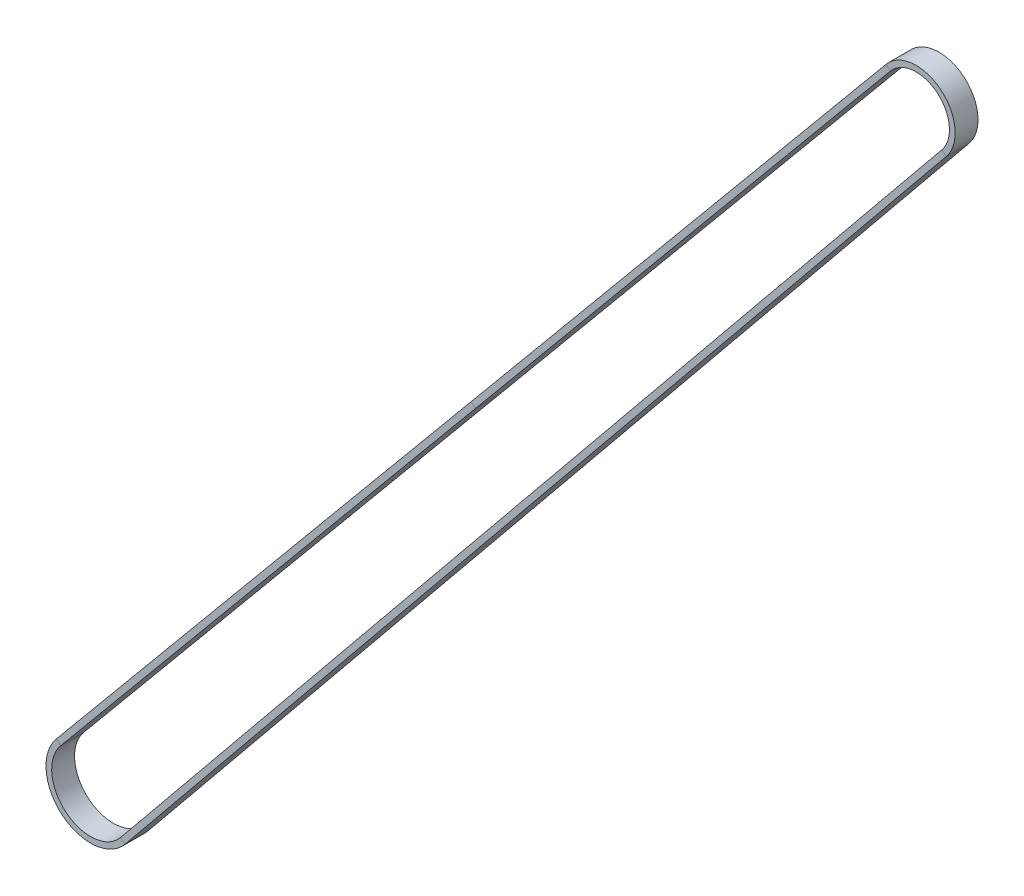
ISO-10303-21;
HEADER;
FILE_DESCRIPTION(('STEP AP214'),'2;1');
FILE_NAME('part.step','',(''),(''),'','','');
FILE_SCHEMA(('AUTOMOTIVE_DESIGN { 1 0 10303 214 1 1 1 1 }'));
ENDSEC;
DATA;
#1=APPLICATION_CONTEXT('core data for automotive mechanical design processes');
#2=APPLICATION_PROTOCOL_DEFINITION('international standard','automotive_design',2000,#1);
#3=PRODUCT_CONTEXT('',#1,'mechanical');
#4=PRODUCT('Part','Part','',(#3));
#5=PRODUCT_RELATED_PRODUCT_CATEGORY('part','',(#4));
#6=PRODUCT_DEFINITION_FORMATION('','',#4);
#7=PRODUCT_DEFINITION_CONTEXT('part definition',#1,'design');
#8=PRODUCT_DEFINITION('design','',#6,#7);
#9=PRODUCT_DEFINITION_SHAPE('','',#8);
#10=(LENGTH_UNIT() NAMED_UNIT(*) SI_UNIT(.MILLI.,.METRE.));
#11=(NAMED_UNIT(*) PLANE_ANGLE_UNIT() SI_UNIT($,.RADIAN.));
#12=(NAMED_UNIT(*) SI_UNIT($,.STERADIAN.) SOLID_ANGLE_UNIT());
#13=UNCERTAINTY_MEASURE_WITH_UNIT(LENGTH_MEASURE(1.E-05),#10,'distance_accuracy_value','');
#14=(GEOMETRIC_REPRESENTATION_CONTEXT(3) GLOBAL_UNCERTAINTY_ASSIGNED_CONTEXT((#13)) GLOBAL_UNIT_ASSIGNED_CONTEXT((#10,
#11,#12)) REPRESENTATION_CONTEXT('',''));
#15=CARTESIAN_POINT('',(0.,0.,0.));
#16=DIRECTION('',(0.,0.,1.));
#17=DIRECTION('',(1.,0.,0.));
#18=AXIS2_PLACEMENT_3D('',#15,#16,#17);
#19=CARTESIAN_POINT('',(-9.00101622856847,7.47473791199665,3.));
#20=DIRECTION('',(0.769317626373385,-0.638866488204867,0.));
#21=DIRECTION('',(0.638866488204868,0.769317626373386,0.));
#22=AXIS2_PLACEMENT_3D('',#19,#20,#21);
#23=PLANE('',#22);
#24=DIRECTION('',(0.,0.,-1.));
#25=VECTOR('',#24,1.);
#26=CARTESIAN_POINT('',(-9.00101622856948,7.4747379119974,3.));
#27=LINE('',#26,#25);
#28=CARTESIAN_POINT('',(-9.00101622856857,7.47473791199665,3.));
#29=VERTEX_POINT('',#28);
#30=CARTESIAN_POINT('',(-9.00101622856857,7.47473791199665,-3.));
#31=VERTEX_POINT('',#30);
#32=EDGE_CURVE('E167',#29,#31,#27,.T.);
#33=ORIENTED_EDGE('',*,*,#32,.F.);
#34=DIRECTION('',(0.638866488204867,0.769317626373385,0.));
#35=VECTOR('',#34,1.);
#36=CARTESIAN_POINT('',(-9.00101622856847,7.47473791199665,3.));
#37=LINE('',#36,#35);
#38=CARTESIAN_POINT('',(99.8938376959289,138.60500079504,3.));
#39=VERTEX_POINT('',#38);
#40=EDGE_CURVE('E166',#29,#39,#37,.T.);
#41=ORIENTED_EDGE('',*,*,#40,.T.);
#42=DIRECTION('',(0.,0.,-1.));
#43=VECTOR('',#42,1.);
#44=CARTESIAN_POINT('',(99.8938376959289,138.60500079504,3.));
#45=LINE('',#44,#43);
#46=CARTESIAN_POINT('',(99.8938376959289,138.60500079504,-3.));
#47=VERTEX_POINT('',#46);
#48=EDGE_CURVE('E141',#39,#47,#45,.T.);
#49=ORIENTED_EDGE('',*,*,#48,.T.);
#50=DIRECTION('',(0.638866488204867,0.769317626373385,0.));
#51=VECTOR('',#50,1.);
#52=CARTESIAN_POINT('',(-9.00101622856847,7.47473791199665,-3.));
#53=LINE('',#52,#51);
#54=EDGE_CURVE('E171',#31,#47,#53,.T.);
#55=ORIENTED_EDGE('',*,*,#54,.F.);
#56=EDGE_LOOP('',(#33,#41,#49,#55));
#57=FACE_BOUND('',#56,.T.);
#58=ADVANCED_FACE('F33',(#57),#23,.F.);
#59=CARTESIAN_POINT('',(99.8938376959289,138.60500079504,3.));
#60=DIRECTION('',(0.769317626373385,-0.638866488204867,0.));
#61=DIRECTION('',(0.638866488204868,0.769317626373386,0.));
#62=AXIS2_PLACEMENT_3D('',#59,#60,#61);
#63=PLANE('',#62);
#64=DIRECTION('',(0.638866488204867,0.769317626373385,0.));
#65=VECTOR('',#64,1.);
#66=CARTESIAN_POINT('',(99.8938376959289,138.60500079504,-3.));
#67=LINE('',#66,#65);
#68=CARTESIAN_POINT('',(208.788691620426,269.735263678083,-3.));
#69=VERTEX_POINT('',#68);
#70=EDGE_CURVE('E147',#47,#69,#67,.T.);
#71=ORIENTED_EDGE('',*,*,#70,.F.);
#72=ORIENTED_EDGE('',*,*,#48,.F.);
#73=DIRECTION('',(0.638866488204867,0.769317626373385,0.));
#74=VECTOR('',#73,1.);
#75=CARTESIAN_POINT('',(99.8938376959289,138.60500079504,3.));
#76=LINE('',#75,#74);
#77=CARTESIAN_POINT('',(208.788691620426,269.735263678083,3.));
#78=VERTEX_POINT('',#77);
#79=EDGE_CURVE('E145',#39,#78,#76,.T.);
#80=ORIENTED_EDGE('',*,*,#79,.T.);
#81=DIRECTION('',(0.,0.,-1.));
#82=VECTOR('',#81,1.);
#83=CARTESIAN_POINT('',(208.788691620426,269.735263678083,3.));
#84=LINE('',#83,#82);
#85=EDGE_CURVE('E163',#78,#69,#84,.T.);
#86=ORIENTED_EDGE('',*,*,#85,.T.);
#87=EDGE_LOOP('',(#71,#72,#80,#86));
#88=FACE_BOUND('',#87,.T.);
#89=ADVANCED_FACE('F143',(#88),#63,.F.);
#90=CARTESIAN_POINT('',(99.8938376959289,138.60500079504,-3.));
#91=DIRECTION('',(0.,0.,1.));
#92=DIRECTION('',(1.,0.,0.));
#93=AXIS2_PLACEMENT_3D('',#90,#91,#92);
#94=PLANE('',#93);
#95=DIRECTION('',(0.638866488204867,0.769317626373385,0.));
#96=VECTOR('',#95,1.);
#97=CARTESIAN_POINT('',(101.047814135489,137.646701062732,-3.));
#98=LINE('',#97,#96);
#99=CARTESIAN_POINT('',(101.047814135489,137.646701062732,-3.));
#100=VERTEX_POINT('',#99);
#101=CARTESIAN_POINT('',(209.942668059986,268.776963945775,-3.));
#102=VERTEX_POINT('',#101);
#103=EDGE_CURVE('E212',#100,#102,#98,.T.);
#104=ORIENTED_EDGE('',*,*,#103,.F.);
#105=DIRECTION('',(0.769317626373389,-0.638866488204863,0.));
#106=VECTOR('',#105,1.);
#107=CARTESIAN_POINT('',(99.8938376959289,138.60500079504,-3.));
#108=LINE('',#107,#106);
#109=EDGE_CURVE('E152',#47,#100,#108,.T.);
#110=ORIENTED_EDGE('',*,*,#109,.F.);
#111=ORIENTED_EDGE('',*,*,#70,.T.);
#112=DIRECTION('',(0.769317626373389,-0.638866488204863,0.));
#113=VECTOR('',#112,1.);
#114=CARTESIAN_POINT('',(208.788691620426,269.735263678083,-3.));
#115=LINE('',#114,#113);
#116=EDGE_CURVE('E237',#69,#102,#115,.T.);
#117=ORIENTED_EDGE('',*,*,#116,.T.);
#118=EDGE_LOOP('',(#104,#110,#111,#117));
#119=FACE_BOUND('',#118,.T.);
#120=ADVANCED_FACE('F257',(#119),#94,.F.);
#121=CARTESIAN_POINT('',(101.047814135489,137.646701062732,3.));
#122=DIRECTION('',(-0.769317626373385,0.638866488204867,0.));
#123=DIRECTION('',(-0.638866488204868,-0.769317626373386,0.));
#124=AXIS2_PLACEMENT_3D('',#121,#122,#123);
#125=PLANE('',#124);
#126=DIRECTION('',(0.638866488204867,0.769317626373385,0.));
#127=VECTOR('',#126,1.);
#128=CARTESIAN_POINT('',(101.047814135489,137.646701062732,3.));
#129=LINE('',#128,#127);
#130=CARTESIAN_POINT('',(101.047814135489,137.646701062732,3.));
#131=VERTEX_POINT('',#130);
#132=CARTESIAN_POINT('',(209.942668059986,268.776963945775,3.));
#133=VERTEX_POINT('',#132);
#134=EDGE_CURVE('E182',#131,#133,#129,.T.);
#135=ORIENTED_EDGE('',*,*,#134,.F.);
#136=DIRECTION('',(0.,0.,1.));
#137=VECTOR('',#136,1.);
#138=CARTESIAN_POINT('',(101.047814135489,137.646701062732,3.));
#139=LINE('',#138,#137);
#140=EDGE_CURVE('E174',#100,#131,#139,.T.);
#141=ORIENTED_EDGE('',*,*,#140,.F.);
#142=ORIENTED_EDGE('',*,*,#103,.T.);
#143=DIRECTION('',(0.,0.,1.));
#144=VECTOR('',#143,1.);
#145=CARTESIAN_POINT('',(209.942668059986,268.776963945775,3.));
#146=LINE('',#145,#144);
#147=EDGE_CURVE('E214',#102,#133,#146,.T.);
#148=ORIENTED_EDGE('',*,*,#147,.T.);
#149=EDGE_LOOP('',(#135,#141,#142,#148));
#150=FACE_BOUND('',#149,.T.);
#151=ADVANCED_FACE('F210',(#150),#125,.F.);
#152=CARTESIAN_POINT('',(99.8938376959289,138.60500079504,3.));
#153=DIRECTION('',(0.,0.,-1.));
#154=DIRECTION('',(-1.,0.,0.));
#155=AXIS2_PLACEMENT_3D('',#152,#153,#154);
#156=PLANE('',#155);
#157=DIRECTION('',(-0.769317626373389,0.638866488204863,0.));
#158=VECTOR('',#157,1.);
#159=CARTESIAN_POINT('',(208.788691620426,269.735263678083,3.));
#160=LINE('',#159,#158);
#161=EDGE_CURVE('E161',#133,#78,#160,.T.);
#162=ORIENTED_EDGE('',*,*,#161,.T.);
#163=ORIENTED_EDGE('',*,*,#79,.F.);
#164=DIRECTION('',(-0.769317626373389,0.638866488204863,0.));
#165=VECTOR('',#164,1.);
#166=CARTESIAN_POINT('',(99.8938376959289,138.60500079504,3.));
#167=LINE('',#166,#165);
#168=EDGE_CURVE('E159',#131,#39,#167,.T.);
#169=ORIENTED_EDGE('',*,*,#168,.F.);
#170=ORIENTED_EDGE('',*,*,#134,.T.);
#171=EDGE_LOOP('',(#162,#163,#169,#170));
#172=FACE_BOUND('',#171,.T.);
#173=ADVANCED_FACE('F157',(#172),#156,.F.);
#174=CARTESIAN_POINT('',(216.674197290753,263.186882173983,0.));
#175=DIRECTION('',(0.,0.,-1.));
#176=DIRECTION('',(-1.,0.,0.));
#177=AXIS2_PLACEMENT_3D('',#174,#175,#176);
#178=CYLINDRICAL_SURFACE('',#177,10.2499999999999);
#179=CARTESIAN_POINT('',(216.674197290753,263.186882173983,-3.));
#180=DIRECTION('',(0.,0.,-1.));
#181=DIRECTION('',(-0.769317626373392,0.63886648820486,0.));
#182=AXIS2_PLACEMENT_3D('',#179,#180,#181);
#183=CIRCLE('',#182,10.2499999999999);
#184=CARTESIAN_POINT('',(224.615122985578,256.705817515358,-3.));
#185=VERTEX_POINT('',#184);
#186=EDGE_CURVE('E126',#69,#185,#183,.T.);
#187=ORIENTED_EDGE('',*,*,#186,.F.);
#188=ORIENTED_EDGE('',*,*,#85,.F.);
#189=CARTESIAN_POINT('',(216.674197290753,263.186882173983,3.));
#190=DIRECTION('',(0.,0.,-1.));
#191=DIRECTION('',(-0.769317626373392,0.63886648820486,0.));
#192=AXIS2_PLACEMENT_3D('',#189,#190,#191);
#193=CIRCLE('',#192,10.2499999999999);
#194=CARTESIAN_POINT('',(224.615122985578,256.705817515358,3.));
#195=VERTEX_POINT('',#194);
#196=EDGE_CURVE('E181',#78,#195,#193,.T.);
#197=ORIENTED_EDGE('',*,*,#196,.T.);
#198=DIRECTION('',(0.,0.,-1.));
#199=VECTOR('',#198,1.);
#200=CARTESIAN_POINT('',(224.615122985578,256.705817515358,3.));
#201=LINE('',#200,#199);
#202=EDGE_CURVE('E242',#195,#185,#201,.T.);
#203=ORIENTED_EDGE('',*,*,#202,.T.);
#204=EDGE_LOOP('',(#187,#188,#197,#203));
#205=FACE_BOUND('',#204,.T.);
#206=ADVANCED_FACE('F282',(#205),#178,.T.);
#207=CARTESIAN_POINT('',(208.788691620426,269.735263678083,-3.));
#208=DIRECTION('',(0.,0.,1.));
#209=DIRECTION('',(1.,0.,0.));
#210=AXIS2_PLACEMENT_3D('',#207,#208,#209);
#211=PLANE('',#210);
#212=CARTESIAN_POINT('',(216.674197290753,263.186882173983,-3.));
#213=DIRECTION('',(0.,0.,-1.));
#214=DIRECTION('',(-0.769317626373394,0.638866488204857,0.));
#215=AXIS2_PLACEMENT_3D('',#212,#213,#214);
#216=CIRCLE('',#215,8.74999999999989);
#217=CARTESIAN_POINT('',(223.45303629853,257.654266001986,-3.));
#218=VERTEX_POINT('',#217);
#219=EDGE_CURVE('E120',#102,#218,#216,.T.);
#220=ORIENTED_EDGE('',*,*,#219,.F.);
#221=ORIENTED_EDGE('',*,*,#116,.F.);
#222=ORIENTED_EDGE('',*,*,#186,.T.);
#223=DIRECTION('',(-0.774724458031634,0.632298991085382,0.));
#224=VECTOR('',#223,1.);
#225=CARTESIAN_POINT('',(224.615122985578,256.705817515358,-3.));
#226=LINE('',#225,#224);
#227=EDGE_CURVE('E219',#185,#218,#226,.T.);
#228=ORIENTED_EDGE('',*,*,#227,.T.);
#229=EDGE_LOOP('',(#220,#221,#222,#228));
#230=FACE_BOUND('',#229,.T.);
#231=ADVANCED_FACE('F284',(#230),#211,.F.);
#232=CARTESIAN_POINT('',(216.674197290753,263.186882173983,0.));
#233=DIRECTION('',(0.,0.,-1.));
#234=DIRECTION('',(-1.,0.,0.));
#235=AXIS2_PLACEMENT_3D('',#232,#233,#234);
#236=CYLINDRICAL_SURFACE('',#235,8.74999999999989);
#237=CARTESIAN_POINT('',(216.674197290753,263.186882173983,3.));
#238=DIRECTION('',(0.,0.,-1.));
#239=DIRECTION('',(-0.769317626373394,0.638866488204857,0.));
#240=AXIS2_PLACEMENT_3D('',#237,#238,#239);
#241=CIRCLE('',#240,8.74999999999989);
#242=CARTESIAN_POINT('',(223.45303629853,257.654266001986,3.));
#243=VERTEX_POINT('',#242);
#244=EDGE_CURVE('E186',#133,#243,#241,.T.);
#245=ORIENTED_EDGE('',*,*,#244,.F.);
#246=ORIENTED_EDGE('',*,*,#147,.F.);
#247=ORIENTED_EDGE('',*,*,#219,.T.);
#248=DIRECTION('',(0.,0.,1.));
#249=VECTOR('',#248,1.);
#250=CARTESIAN_POINT('',(223.45303629853,257.654266001986,3.));
#251=LINE('',#250,#249);
#252=EDGE_CURVE('E218',#218,#243,#251,.T.);
#253=ORIENTED_EDGE('',*,*,#252,.T.);
#254=EDGE_LOOP('',(#245,#246,#247,#253));
#255=FACE_BOUND('',#254,.T.);
#256=ADVANCED_FACE('F290',(#255),#236,.F.);
#257=CARTESIAN_POINT('',(208.788691620426,269.735263678083,3.));
#258=DIRECTION('',(0.,0.,-1.));
#259=DIRECTION('',(-1.,0.,0.));
#260=AXIS2_PLACEMENT_3D('',#257,#258,#259);
#261=PLANE('',#260);
#262=DIRECTION('',(0.774724458031634,-0.632298991085382,0.));
#263=VECTOR('',#262,1.);
#264=CARTESIAN_POINT('',(224.615122985578,256.705817515358,3.));
#265=LINE('',#264,#263);
#266=EDGE_CURVE('E183',#243,#195,#265,.T.);
#267=ORIENTED_EDGE('',*,*,#266,.T.);
#268=ORIENTED_EDGE('',*,*,#196,.F.);
#269=ORIENTED_EDGE('',*,*,#161,.F.);
#270=ORIENTED_EDGE('',*,*,#244,.T.);
#271=EDGE_LOOP('',(#267,#268,#269,#270));
#272=FACE_BOUND('',#271,.T.);
#273=ADVANCED_FACE('F280',(#272),#261,.F.);
#274=CARTESIAN_POINT('',(224.615122985578,256.705817515358,3.));
#275=DIRECTION('',(-0.774724458031631,0.632298991085385,0.));
#276=DIRECTION('',(-0.632298991085385,-0.774724458031631,0.));
#277=AXIS2_PLACEMENT_3D('',#274,#275,#276);
#278=PLANE('',#277);
#279=DIRECTION('',(-0.632298991085385,-0.774724458031631,0.));
#280=VECTOR('',#279,1.);
#281=CARTESIAN_POINT('',(224.615122985578,256.705817515358,-3.));
#282=LINE('',#281,#280);
#283=CARTESIAN_POINT('',(9.06427615897029,-7.39789819569914,-3.));
#284=VERTEX_POINT('',#283);
#285=EDGE_CURVE('E103',#185,#284,#282,.T.);
#286=ORIENTED_EDGE('',*,*,#285,.F.);
#287=ORIENTED_EDGE('',*,*,#202,.F.);
#288=DIRECTION('',(-0.632298991085385,-0.774724458031631,0.));
#289=VECTOR('',#288,1.);
#290=CARTESIAN_POINT('',(224.615122985578,256.705817515358,3.));
#291=LINE('',#290,#289);
#292=CARTESIAN_POINT('',(9.06427615897029,-7.39789819569914,3.));
#293=VERTEX_POINT('',#292);
#294=EDGE_CURVE('E185',#195,#293,#291,.T.);
#295=ORIENTED_EDGE('',*,*,#294,.T.);
#296=DIRECTION('',(0.,0.,-1.));
#297=VECTOR('',#296,1.);
#298=CARTESIAN_POINT('',(9.06427615897028,-7.39789819569919,3.));
#299=LINE('',#298,#297);
#300=EDGE_CURVE('E195',#293,#284,#299,.T.);
#301=ORIENTED_EDGE('',*,*,#300,.T.);
#302=EDGE_LOOP('',(#286,#287,#295,#301));
#303=FACE_BOUND('',#302,.T.);
#304=ADVANCED_FACE('F276',(#303),#278,.F.);
#305=CARTESIAN_POINT('',(224.615122985578,256.705817515358,-3.));
#306=DIRECTION('',(0.,0.,1.));
#307=DIRECTION('',(1.,0.,0.));
#308=AXIS2_PLACEMENT_3D('',#305,#306,#307);
#309=PLANE('',#308);
#310=DIRECTION('',(-0.632298991085385,-0.774724458031631,0.));
#311=VECTOR('',#310,1.);
#312=CARTESIAN_POINT('',(223.45303629853,257.654266001986,-3.));
#313=LINE('',#312,#311);
#314=CARTESIAN_POINT('',(7.90218947192284,-6.44944970907108,-3.));
#315=VERTEX_POINT('',#314);
#316=EDGE_CURVE('E96',#218,#315,#313,.T.);
#317=ORIENTED_EDGE('',*,*,#316,.F.);
#318=ORIENTED_EDGE('',*,*,#227,.F.);
#319=ORIENTED_EDGE('',*,*,#285,.T.);
#320=DIRECTION('',(-0.774724458031635,0.63229899108538,0.));
#321=VECTOR('',#320,1.);
#322=CARTESIAN_POINT('',(9.06427615897028,-7.39789819569919,-3.));
#323=LINE('',#322,#321);
#324=EDGE_CURVE('E193',#284,#315,#323,.T.);
#325=ORIENTED_EDGE('',*,*,#324,.T.);
#326=EDGE_LOOP('',(#317,#318,#319,#325));
#327=FACE_BOUND('',#326,.T.);
#328=ADVANCED_FACE('F279',(#327),#309,.F.);
#329=CARTESIAN_POINT('',(223.45303629853,257.654266001986,3.));
#330=DIRECTION('',(0.774724458031631,-0.632298991085385,0.));
#331=DIRECTION('',(0.632298991085385,0.774724458031631,0.));
#332=AXIS2_PLACEMENT_3D('',#329,#330,#331);
#333=PLANE('',#332);
#334=DIRECTION('',(-0.632298991085385,-0.774724458031631,0.));
#335=VECTOR('',#334,1.);
#336=CARTESIAN_POINT('',(223.45303629853,257.654266001986,3.));
#337=LINE('',#336,#335);
#338=CARTESIAN_POINT('',(7.90218947192284,-6.44944970907108,3.));
#339=VERTEX_POINT('',#338);
#340=EDGE_CURVE('E87',#243,#339,#337,.T.);
#341=ORIENTED_EDGE('',*,*,#340,.F.);
#342=ORIENTED_EDGE('',*,*,#252,.F.);
#343=ORIENTED_EDGE('',*,*,#316,.T.);
#344=DIRECTION('',(0.,0.,1.));
#345=VECTOR('',#344,1.);
#346=CARTESIAN_POINT('',(7.90218947192282,-6.4494497090711,3.));
#347=LINE('',#346,#345);
#348=EDGE_CURVE('E189',#315,#339,#347,.T.);
#349=ORIENTED_EDGE('',*,*,#348,.T.);
#350=EDGE_LOOP('',(#341,#342,#343,#349));
#351=FACE_BOUND('',#350,.T.);
#352=ADVANCED_FACE('F294',(#351),#333,.F.);
#353=CARTESIAN_POINT('',(224.615122985578,256.705817515358,3.));
#354=DIRECTION('',(0.,0.,-1.));
#355=DIRECTION('',(-1.,0.,0.));
#356=AXIS2_PLACEMENT_3D('',#353,#354,#355);
#357=PLANE('',#356);
#358=DIRECTION('',(0.774724458031635,-0.63229899108538,0.));
#359=VECTOR('',#358,1.);
#360=CARTESIAN_POINT('',(9.06427615897028,-7.39789819569919,3.));
#361=LINE('',#360,#359);
#362=EDGE_CURVE('E187',#339,#293,#361,.T.);
#363=ORIENTED_EDGE('',*,*,#362,.T.);
#364=ORIENTED_EDGE('',*,*,#294,.F.);
#365=ORIENTED_EDGE('',*,*,#266,.F.);
#366=ORIENTED_EDGE('',*,*,#340,.T.);
#367=EDGE_LOOP('',(#363,#364,#365,#366));
#368=FACE_BOUND('',#367,.T.);
#369=ADVANCED_FACE('F275',(#368),#357,.F.);
#370=CARTESIAN_POINT('',(1.1111561790806E-13,-2.22140751027583E-13,0.));
#371=DIRECTION('',(0.,0.,-1.));
#372=DIRECTION('',(-1.,0.,0.));
#373=AXIS2_PLACEMENT_3D('',#370,#371,#372);
#374=CYLINDRICAL_SURFACE('',#373,11.7);
#375=CARTESIAN_POINT('',(1.1111561790806E-13,-2.22140751027583E-13,-3.));
#376=DIRECTION('',(0.,0.,-1.));
#377=DIRECTION('',(0.774724458031635,-0.63229899108538,0.));
#378=AXIS2_PLACEMENT_3D('',#375,#376,#377);
#379=CIRCLE('',#378,11.7);
#380=EDGE_CURVE('E227',#284,#31,#379,.T.);
#381=ORIENTED_EDGE('',*,*,#380,.F.);
#382=ORIENTED_EDGE('',*,*,#300,.F.);
#383=CARTESIAN_POINT('',(1.1111561790806E-13,-2.22140751027583E-13,3.));
#384=DIRECTION('',(0.,0.,-1.));
#385=DIRECTION('',(0.774724458031635,-0.63229899108538,0.));
#386=AXIS2_PLACEMENT_3D('',#383,#384,#385);
#387=CIRCLE('',#386,11.7);
#388=EDGE_CURVE('E188',#293,#29,#387,.T.);
#389=ORIENTED_EDGE('',*,*,#388,.T.);
#390=ORIENTED_EDGE('',*,*,#32,.T.);
#391=EDGE_LOOP('',(#381,#382,#389,#390));
#392=FACE_BOUND('',#391,.T.);
#393=ADVANCED_FACE('F272',(#392),#374,.T.);
#394=CARTESIAN_POINT('',(9.06427615897025,-7.39789819569916,-3.));
#395=DIRECTION('',(0.,0.,1.));
#396=DIRECTION('',(1.,0.,0.));
#397=AXIS2_PLACEMENT_3D('',#394,#395,#396);
#398=PLANE('',#397);
#399=CARTESIAN_POINT('',(1.1111561790806E-13,-2.22140751027583E-13,-3.));
#400=DIRECTION('',(0.,0.,-1.));
#401=DIRECTION('',(0.774724458031636,-0.632298991085378,0.));
#402=AXIS2_PLACEMENT_3D('',#399,#400,#401);
#403=CIRCLE('',#402,10.2);
#404=CARTESIAN_POINT('',(-7.84703978900848,6.51643817968934,-3.));
#405=VERTEX_POINT('',#404);
#406=EDGE_CURVE('E58',#315,#405,#403,.T.);
#407=ORIENTED_EDGE('',*,*,#406,.F.);
#408=ORIENTED_EDGE('',*,*,#324,.F.);
#409=ORIENTED_EDGE('',*,*,#380,.T.);
#410=DIRECTION('',(0.769317626373389,-0.638866488204863,0.));
#411=VECTOR('',#410,1.);
#412=CARTESIAN_POINT('',(-9.00101622856948,7.4747379119974,-3.));
#413=LINE('',#412,#411);
#414=EDGE_CURVE('E225',#31,#405,#413,.T.);
#415=ORIENTED_EDGE('',*,*,#414,.T.);
#416=EDGE_LOOP('',(#407,#408,#409,#415));
#417=FACE_BOUND('',#416,.T.);
#418=ADVANCED_FACE('F253',(#417),#398,.F.);
#419=CARTESIAN_POINT('',(1.1111561790806E-13,-2.22140751027583E-13,0.));
#420=DIRECTION('',(0.,0.,-1.));
#421=DIRECTION('',(-1.,0.,0.));
#422=AXIS2_PLACEMENT_3D('',#419,#420,#421);
#423=CYLINDRICAL_SURFACE('',#422,10.2);
#424=CARTESIAN_POINT('',(1.1111561790806E-13,-2.22140751027583E-13,3.));
#425=DIRECTION('',(0.,0.,-1.));
#426=DIRECTION('',(0.774724458031636,-0.632298991085378,0.));
#427=AXIS2_PLACEMENT_3D('',#424,#425,#426);
#428=CIRCLE('',#427,10.2);
#429=CARTESIAN_POINT('',(-7.84703978900848,6.51643817968934,3.));
#430=VERTEX_POINT('',#429);
#431=EDGE_CURVE('E50',#339,#430,#428,.T.);
#432=ORIENTED_EDGE('',*,*,#431,.F.);
#433=ORIENTED_EDGE('',*,*,#348,.F.);
#434=ORIENTED_EDGE('',*,*,#406,.T.);
#435=DIRECTION('',(0.,0.,1.));
#436=VECTOR('',#435,1.);
#437=CARTESIAN_POINT('',(-7.8470397890094,6.51643817969011,3.));
#438=LINE('',#437,#436);
#439=EDGE_CURVE('E201',#405,#430,#438,.T.);
#440=ORIENTED_EDGE('',*,*,#439,.T.);
#441=EDGE_LOOP('',(#432,#433,#434,#440));
#442=FACE_BOUND('',#441,.T.);
#443=ADVANCED_FACE('F303',(#442),#423,.F.);
#444=CARTESIAN_POINT('',(9.06427615897025,-7.39789819569916,3.));
#445=DIRECTION('',(0.,0.,-1.));
#446=DIRECTION('',(-1.,0.,0.));
#447=AXIS2_PLACEMENT_3D('',#444,#445,#446);
#448=PLANE('',#447);
#449=DIRECTION('',(-0.769317626373389,0.638866488204863,0.));
#450=VECTOR('',#449,1.);
#451=CARTESIAN_POINT('',(-9.00101622856948,7.4747379119974,3.));
#452=LINE('',#451,#450);
#453=EDGE_CURVE('E37',#430,#29,#452,.T.);
#454=ORIENTED_EDGE('',*,*,#453,.T.);
#455=ORIENTED_EDGE('',*,*,#388,.F.);
#456=ORIENTED_EDGE('',*,*,#362,.F.);
#457=ORIENTED_EDGE('',*,*,#431,.T.);
#458=EDGE_LOOP('',(#454,#455,#456,#457));
#459=FACE_BOUND('',#458,.T.);
#460=ADVANCED_FACE('F202',(#459),#448,.F.);
#461=CARTESIAN_POINT('',(-9.00101622856847,7.47473791199665,-3.));
#462=DIRECTION('',(0.,0.,1.));
#463=DIRECTION('',(1.,0.,0.));
#464=AXIS2_PLACEMENT_3D('',#461,#462,#463);
#465=PLANE('',#464);
#466=ORIENTED_EDGE('',*,*,#54,.T.);
#467=ORIENTED_EDGE('',*,*,#109,.T.);
#468=DIRECTION('',(0.638866488204867,0.769317626373385,0.));
#469=VECTOR('',#468,1.);
#470=CARTESIAN_POINT('',(-7.84703978900839,6.51643817968936,-3.));
#471=LINE('',#470,#469);
#472=EDGE_CURVE('E42',#405,#100,#471,.T.);
#473=ORIENTED_EDGE('',*,*,#472,.F.);
#474=ORIENTED_EDGE('',*,*,#414,.F.);
#475=EDGE_LOOP('',(#466,#467,#473,#474));
#476=FACE_BOUND('',#475,.T.);
#477=ADVANCED_FACE('F256',(#476),#465,.F.);
#478=CARTESIAN_POINT('',(-7.84703978900839,6.51643817968936,3.));
#479=DIRECTION('',(-0.769317626373385,0.638866488204867,0.));
#480=DIRECTION('',(-0.638866488204868,-0.769317626373386,0.));
#481=AXIS2_PLACEMENT_3D('',#478,#479,#480);
#482=PLANE('',#481);
#483=ORIENTED_EDGE('',*,*,#472,.T.);
#484=ORIENTED_EDGE('',*,*,#140,.T.);
#485=DIRECTION('',(0.638866488204867,0.769317626373385,0.));
#486=VECTOR('',#485,1.);
#487=CARTESIAN_POINT('',(-7.84703978900839,6.51643817968936,3.));
#488=LINE('',#487,#486);
#489=EDGE_CURVE('E11',#430,#131,#488,.T.);
#490=ORIENTED_EDGE('',*,*,#489,.F.);
#491=ORIENTED_EDGE('',*,*,#439,.F.);
#492=EDGE_LOOP('',(#483,#484,#490,#491));
#493=FACE_BOUND('',#492,.T.);
#494=ADVANCED_FACE('F206',(#493),#482,.F.);
#495=CARTESIAN_POINT('',(-9.00101622856847,7.47473791199665,3.));
#496=DIRECTION('',(0.,0.,-1.));
#497=DIRECTION('',(-1.,0.,0.));
#498=AXIS2_PLACEMENT_3D('',#495,#496,#497);
#499=PLANE('',#498);
#500=ORIENTED_EDGE('',*,*,#489,.T.);
#501=ORIENTED_EDGE('',*,*,#168,.T.);
#502=ORIENTED_EDGE('',*,*,#40,.F.);
#503=ORIENTED_EDGE('',*,*,#453,.F.);
#504=EDGE_LOOP('',(#500,#501,#502,#503));
#505=FACE_BOUND('',#504,.T.);
#506=ADVANCED_FACE('F35',(#505),#499,.F.);
#507=CLOSED_SHELL('',(#58,#89,#120,#151,#173,#206,#231,#256,#273,#304,#328,#352,#369,#393,#418,
#443,#460,#477,#494,#506));
#508=MANIFOLD_SOLID_BREP('B2',#507);
#509=ADVANCED_BREP_SHAPE_REPRESENTATION('',(#18,#508),#14);
#510=SHAPE_DEFINITION_REPRESENTATION(#9,#509);
ENDSEC;
END-ISO-10303-21;
